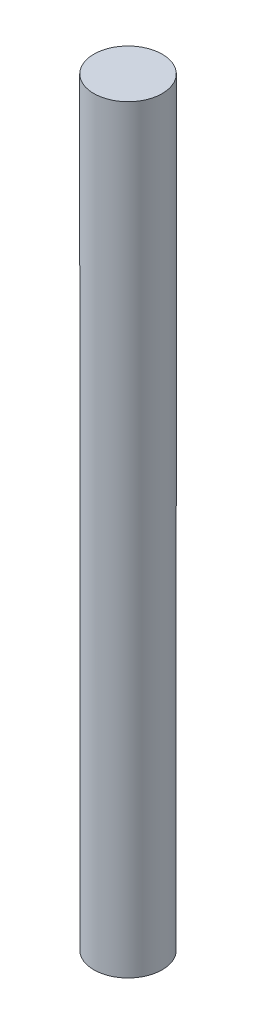
ISO-10303-21;
HEADER;
FILE_DESCRIPTION(('STEP AP214'),'2;1');
FILE_NAME('part.step','',(''),(''),'','','');
FILE_SCHEMA(('AUTOMOTIVE_DESIGN { 1 0 10303 214 1 1 1 1 }'));
ENDSEC;
DATA;
#1=APPLICATION_CONTEXT('core data for automotive mechanical design processes');
#2=APPLICATION_PROTOCOL_DEFINITION('international standard','automotive_design',2000,#1);
#3=PRODUCT_CONTEXT('',#1,'mechanical');
#4=PRODUCT('Part','Part','',(#3));
#5=PRODUCT_RELATED_PRODUCT_CATEGORY('part','',(#4));
#6=PRODUCT_DEFINITION_FORMATION('','',#4);
#7=PRODUCT_DEFINITION_CONTEXT('part definition',#1,'design');
#8=PRODUCT_DEFINITION('design','',#6,#7);
#9=PRODUCT_DEFINITION_SHAPE('','',#8);
#10=(LENGTH_UNIT() NAMED_UNIT(*) SI_UNIT(.MILLI.,.METRE.));
#11=(NAMED_UNIT(*) PLANE_ANGLE_UNIT() SI_UNIT($,.RADIAN.));
#12=(NAMED_UNIT(*) SI_UNIT($,.STERADIAN.) SOLID_ANGLE_UNIT());
#13=UNCERTAINTY_MEASURE_WITH_UNIT(LENGTH_MEASURE(1.E-05),#10,'distance_accuracy_value','');
#14=(GEOMETRIC_REPRESENTATION_CONTEXT(3) GLOBAL_UNCERTAINTY_ASSIGNED_CONTEXT((#13)) GLOBAL_UNIT_ASSIGNED_CONTEXT((#10,
#11,#12)) REPRESENTATION_CONTEXT('',''));
#15=CARTESIAN_POINT('',(0.,0.,0.));
#16=DIRECTION('',(0.,0.,1.));
#17=DIRECTION('',(1.,0.,0.));
#18=AXIS2_PLACEMENT_3D('',#15,#16,#17);
#19=CARTESIAN_POINT('',(465.,-210.6,59.5));
#20=DIRECTION('',(0.,-1.,0.));
#21=DIRECTION('',(0.,0.,-1.));
#22=AXIS2_PLACEMENT_3D('',#19,#20,#21);
#23=PLANE('',#22);
#24=CARTESIAN_POINT('',(465.,-210.6,59.5));
#25=DIRECTION('',(0.,-1.,0.));
#26=DIRECTION('',(0.,0.,1.));
#27=AXIS2_PLACEMENT_3D('',#24,#25,#26);
#28=CIRCLE('',#27,4.5);
#29=CARTESIAN_POINT('',(465.,-210.6,64.));
#30=VERTEX_POINT('',#29);
#31=EDGE_CURVE('E10',#30,#30,#28,.T.);
#32=ORIENTED_EDGE('',*,*,#31,.T.);
#33=EDGE_LOOP('',(#32));
#34=FACE_BOUND('',#33,.T.);
#35=ADVANCED_FACE('F15',(#34),#23,.T.);
#36=CARTESIAN_POINT('',(465.,-110.6,59.5));
#37=DIRECTION('',(0.,-1.,0.));
#38=DIRECTION('',(1.,0.,0.));
#39=AXIS2_PLACEMENT_3D('',#36,#37,#38);
#40=CYLINDRICAL_SURFACE('',#39,4.5);
#41=CARTESIAN_POINT('',(465.,-110.6,59.5));
#42=DIRECTION('',(0.,-1.,0.));
#43=DIRECTION('',(0.,0.,-1.));
#44=AXIS2_PLACEMENT_3D('',#41,#42,#43);
#45=CIRCLE('',#44,4.5);
#46=CARTESIAN_POINT('',(465.,-110.6,55.));
#47=VERTEX_POINT('',#46);
#48=EDGE_CURVE('E22',#47,#47,#45,.F.);
#49=ORIENTED_EDGE('',*,*,#48,.F.);
#50=EDGE_LOOP('',(#49));
#51=FACE_BOUND('',#50,.T.);
#52=ORIENTED_EDGE('',*,*,#31,.F.);
#53=EDGE_LOOP('',(#52));
#54=FACE_BOUND('',#53,.T.);
#55=ADVANCED_FACE('F17',(#51,#54),#40,.T.);
#56=CARTESIAN_POINT('',(0.,-110.6,0.));
#57=DIRECTION('',(0.,-1.,0.));
#58=DIRECTION('',(0.,0.,-1.));
#59=AXIS2_PLACEMENT_3D('',#56,#57,#58);
#60=PLANE('',#59);
#61=ORIENTED_EDGE('',*,*,#48,.T.);
#62=EDGE_LOOP('',(#61));
#63=FACE_BOUND('',#62,.T.);
#64=ADVANCED_FACE('F28',(#63),#60,.F.);
#65=CLOSED_SHELL('',(#35,#55,#64));
#66=MANIFOLD_SOLID_BREP('B1',#65);
#67=ADVANCED_BREP_SHAPE_REPRESENTATION('',(#18,#66),#14);
#68=SHAPE_DEFINITION_REPRESENTATION(#9,#67);
ENDSEC;
END-ISO-10303-21;
